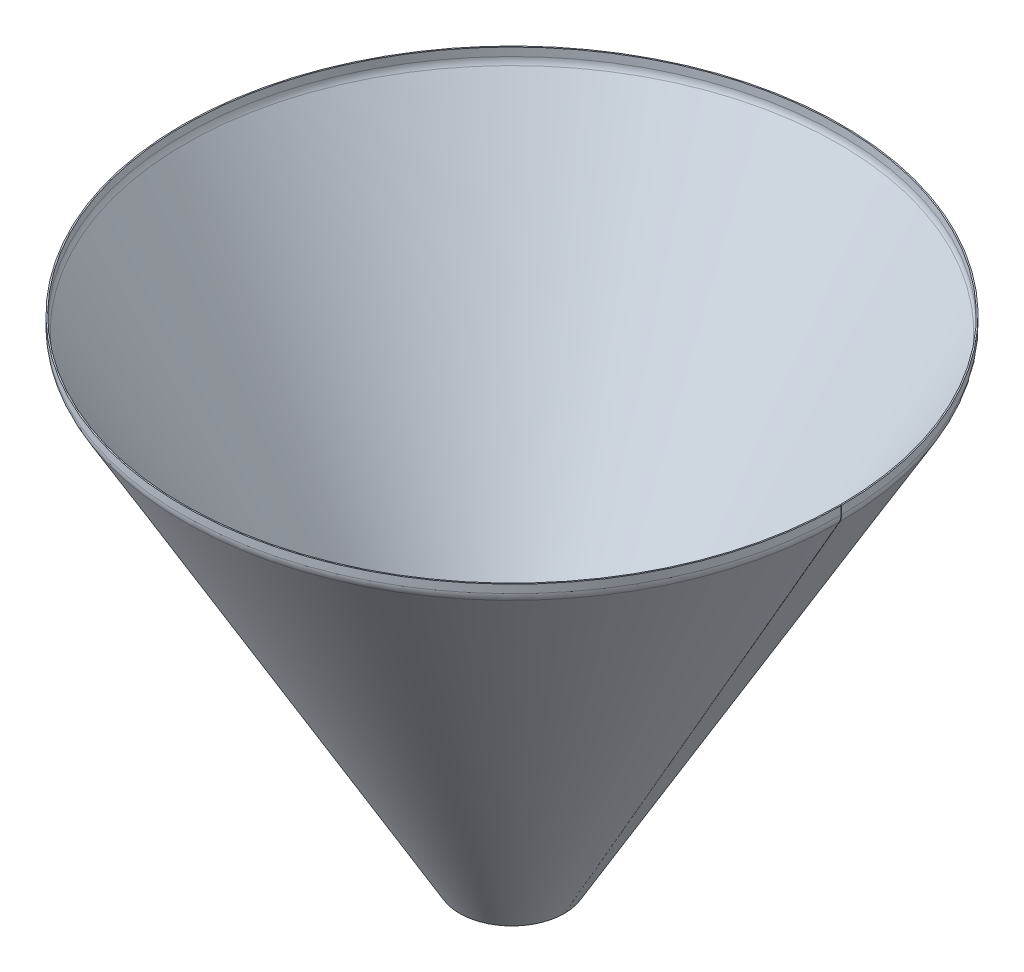
ISO-10303-21;
HEADER;
FILE_DESCRIPTION(('STEP AP214'),'2;1');
FILE_NAME('part.step','',(''),(''),'','','');
FILE_SCHEMA(('AUTOMOTIVE_DESIGN { 1 0 10303 214 1 1 1 1 }'));
ENDSEC;
DATA;
#1=APPLICATION_CONTEXT('core data for automotive mechanical design processes');
#2=APPLICATION_PROTOCOL_DEFINITION('international standard','automotive_design',2000,#1);
#3=PRODUCT_CONTEXT('',#1,'mechanical');
#4=PRODUCT('Part','Part','',(#3));
#5=PRODUCT_RELATED_PRODUCT_CATEGORY('part','',(#4));
#6=PRODUCT_DEFINITION_FORMATION('','',#4);
#7=PRODUCT_DEFINITION_CONTEXT('part definition',#1,'design');
#8=PRODUCT_DEFINITION('design','',#6,#7);
#9=PRODUCT_DEFINITION_SHAPE('','',#8);
#10=(LENGTH_UNIT() NAMED_UNIT(*) SI_UNIT(.MILLI.,.METRE.));
#11=(NAMED_UNIT(*) PLANE_ANGLE_UNIT() SI_UNIT($,.RADIAN.));
#12=(NAMED_UNIT(*) SI_UNIT($,.STERADIAN.) SOLID_ANGLE_UNIT());
#13=UNCERTAINTY_MEASURE_WITH_UNIT(LENGTH_MEASURE(1.E-05),#10,'distance_accuracy_value','');
#14=(GEOMETRIC_REPRESENTATION_CONTEXT(3) GLOBAL_UNCERTAINTY_ASSIGNED_CONTEXT((#13)) GLOBAL_UNIT_ASSIGNED_CONTEXT((#10,
#11,#12)) REPRESENTATION_CONTEXT('',''));
#15=CARTESIAN_POINT('',(0.,0.,0.));
#16=DIRECTION('',(0.,0.,1.));
#17=DIRECTION('',(1.,0.,0.));
#18=AXIS2_PLACEMENT_3D('',#15,#16,#17);
#19=CARTESIAN_POINT('',(-35.0011651613349,-20.,1.33517619991212));
#20=DIRECTION('',(0.0017453283658982,0.,-0.999998476913288));
#21=DIRECTION('',(-0.999998476913288,0.,-0.0017453283658982));
#22=AXIS2_PLACEMENT_3D('',#19,#20,#21);
#23=PLANE('',#22);
#24=DIRECTION('',(-0.999998476913288,0.,-0.00174532836589845));
#25=VECTOR('',#24,1.);
#26=CARTESIAN_POINT('',(-0.00121846936984582,-20.,1.39626269271876));
#27=LINE('',#26,#25);
#28=CARTESIAN_POINT('',(-0.00121846936984582,-20.,1.39626269271876));
#29=VERTEX_POINT('',#28);
#30=CARTESIAN_POINT('',(-3.00121390010977,-20.,1.39102670762109));
#31=VERTEX_POINT('',#30);
#32=EDGE_CURVE('E11',#29,#31,#27,.T.);
#33=ORIENTED_EDGE('',*,*,#32,.F.);
#34=CARTESIAN_POINT('',(-35.0011651613349,-20.,1.33517619991212));
#35=DIRECTION('',(-0.0017453283658982,0.,0.999998476913288));
#36=DIRECTION('',(0.999998476913288,0.,0.0017453283658982));
#37=AXIS2_PLACEMENT_3D('',#34,#35,#36);
#38=CIRCLE('',#37,35.);
#39=CARTESIAN_POINT('',(-4.69032219499199,-37.5,1.38807865451079));
#40=VERTEX_POINT('',#39);
#41=EDGE_CURVE('E140',#40,#29,#38,.T.);
#42=ORIENTED_EDGE('',*,*,#41,.F.);
#43=DIRECTION('',(-0.866024084752653,0.500000000000001,-0.00151149870281363));
#44=VECTOR('',#43,1.);
#45=CARTESIAN_POINT('',(-4.69032219499199,-37.5,1.38807865451079));
#46=LINE('',#45,#44);
#47=CARTESIAN_POINT('',(-7.28839444925,-36.,1.38354415840238));
#48=VERTEX_POINT('',#47);
#49=EDGE_CURVE('E53',#40,#48,#46,.T.);
#50=ORIENTED_EDGE('',*,*,#49,.T.);
#51=CARTESIAN_POINT('',(-35.001165161335,-20.,1.33517619991217));
#52=DIRECTION('',(-0.00174532836589826,0.,0.999998476913288));
#53=DIRECTION('',(0.999998476913288,0.,0.00174532836589826));
#54=AXIS2_PLACEMENT_3D('',#51,#52,#53);
#55=CIRCLE('',#54,32.);
#56=EDGE_CURVE('E137',#48,#31,#55,.T.);
#57=ORIENTED_EDGE('',*,*,#56,.T.);
#58=EDGE_LOOP('',(#33,#42,#50,#57));
#59=FACE_BOUND('',#58,.T.);
#60=ADVANCED_FACE('F43',(#59),#23,.T.);
#61=CARTESIAN_POINT('',(-4.69032219499207,-37.5,1.38807865451059));
#62=DIRECTION('',(0.0017453283658982,0.,-0.999998476913288));
#63=DIRECTION('',(0.499999238456645,0.866025403784438,0.000872664182949101));
#64=AXIS2_PLACEMENT_3D('',#61,#62,#63);
#65=PLANE('',#64);
#66=ORIENTED_EDGE('',*,*,#49,.F.);
#67=DIRECTION('',(0.499999238456645,0.866025403784438,0.000872664182949101));
#68=VECTOR('',#67,1.);
#69=CARTESIAN_POINT('',(-4.69032219499207,-37.5,1.38807865451059));
#70=LINE('',#69,#68);
#71=CARTESIAN_POINT('',(-672.500194193556,-1194.18238982516,0.222529366652052));
#72=VERTEX_POINT('',#71);
#73=EDGE_CURVE('E180',#72,#40,#70,.T.);
#74=ORIENTED_EDGE('',*,*,#73,.F.);
#75=DIRECTION('',(-0.866024084752653,0.500000000000001,-0.00151149870281363));
#76=VECTOR('',#75,1.);
#77=CARTESIAN_POINT('',(-672.500194193556,-1194.18238982516,0.222529366652052));
#78=LINE('',#77,#76);
#79=CARTESIAN_POINT('',(-675.098266447814,-1192.68238982516,0.217994870543588));
#80=VERTEX_POINT('',#79);
#81=EDGE_CURVE('E129',#72,#80,#78,.T.);
#82=ORIENTED_EDGE('',*,*,#81,.T.);
#83=DIRECTION('',(0.499999238456645,0.866025403784438,0.000872664182949132));
#84=VECTOR('',#83,1.);
#85=CARTESIAN_POINT('',(-675.098266447814,-1192.68238982516,0.217994870543588));
#86=LINE('',#85,#84);
#87=EDGE_CURVE('E157',#80,#48,#86,.T.);
#88=ORIENTED_EDGE('',*,*,#87,.T.);
#89=EDGE_LOOP('',(#66,#74,#82,#88));
#90=FACE_BOUND('',#89,.T.);
#91=ADVANCED_FACE('F158',(#90),#65,.T.);
#92=CARTESIAN_POINT('',(-800.,-1194.18238982516,0.));
#93=DIRECTION('',(0.,-1.,0.));
#94=DIRECTION('',(0.,0.,-1.));
#95=AXIS2_PLACEMENT_3D('',#92,#93,#94);
#96=CONICAL_SURFACE('',#95,127.5,1.0471975511966);
#97=ORIENTED_EDGE('',*,*,#81,.F.);
#98=CARTESIAN_POINT('',(-800.,-1194.18238982516,0.));
#99=DIRECTION('',(0.,1.,0.));
#100=DIRECTION('',(1.,0.,0.));
#101=AXIS2_PLACEMENT_3D('',#98,#99,#100);
#102=CIRCLE('',#101,127.5);
#103=CARTESIAN_POINT('',(-672.5,-1194.18238982516,0.));
#104=VERTEX_POINT('',#103);
#105=EDGE_CURVE('E107',#104,#72,#102,.T.);
#106=ORIENTED_EDGE('',*,*,#105,.F.);
#107=DIRECTION('',(-0.866025403784438,0.500000000000001,0.));
#108=VECTOR('',#107,1.);
#109=CARTESIAN_POINT('',(-672.5,-1194.18238982516,0.));
#110=LINE('',#109,#108);
#111=CARTESIAN_POINT('',(-675.098076211353,-1192.68238982516,0.));
#112=VERTEX_POINT('',#111);
#113=EDGE_CURVE('E126',#104,#112,#110,.T.);
#114=ORIENTED_EDGE('',*,*,#113,.T.);
#115=CARTESIAN_POINT('',(-800.,-1192.68238982516,0.));
#116=DIRECTION('',(0.,1.,0.));
#117=DIRECTION('',(0.,0.,1.));
#118=AXIS2_PLACEMENT_3D('',#115,#116,#117);
#119=CIRCLE('',#118,124.901923788647);
#120=EDGE_CURVE('E162',#112,#80,#119,.T.);
#121=ORIENTED_EDGE('',*,*,#120,.T.);
#122=EDGE_LOOP('',(#97,#106,#114,#121));
#123=FACE_BOUND('',#122,.T.);
#124=ADVANCED_FACE('F219',(#123),#96,.F.);
#125=CARTESIAN_POINT('',(-4.68911086754468,-37.5,0.));
#126=DIRECTION('',(0.,0.,-1.));
#127=DIRECTION('',(0.500000000000001,0.866025403784438,0.));
#128=AXIS2_PLACEMENT_3D('',#125,#126,#127);
#129=PLANE('',#128);
#130=ORIENTED_EDGE('',*,*,#113,.F.);
#131=DIRECTION('',(0.500000000000001,0.866025403784438,0.));
#132=VECTOR('',#131,1.);
#133=CARTESIAN_POINT('',(-4.68911086754468,-37.5,0.));
#134=LINE('',#133,#132);
#135=CARTESIAN_POINT('',(-4.68911086754464,-37.5,0.));
#136=VERTEX_POINT('',#135);
#137=EDGE_CURVE('E177',#104,#136,#134,.T.);
#138=ORIENTED_EDGE('',*,*,#137,.T.);
#139=DIRECTION('',(-0.866025403784438,0.5,0.));
#140=VECTOR('',#139,1.);
#141=CARTESIAN_POINT('',(-4.68911086754464,-37.5,0.));
#142=LINE('',#141,#140);
#143=CARTESIAN_POINT('',(-7.28718707889797,-36.,0.));
#144=VERTEX_POINT('',#143);
#145=EDGE_CURVE('E123',#136,#144,#142,.T.);
#146=ORIENTED_EDGE('',*,*,#145,.T.);
#147=DIRECTION('',(0.500000000000001,0.866025403784438,0.));
#148=VECTOR('',#147,1.);
#149=CARTESIAN_POINT('',(-675.098076211353,-1192.68238982516,0.));
#150=LINE('',#149,#148);
#151=EDGE_CURVE('E114',#112,#144,#150,.T.);
#152=ORIENTED_EDGE('',*,*,#151,.F.);
#153=EDGE_LOOP('',(#130,#138,#146,#152));
#154=FACE_BOUND('',#153,.T.);
#155=ADVANCED_FACE('F224',(#154),#129,.F.);
#156=CARTESIAN_POINT('',(-35.,-20.,0.));
#157=DIRECTION('',(0.,0.,-1.));
#158=DIRECTION('',(-1.,0.,0.));
#159=AXIS2_PLACEMENT_3D('',#156,#157,#158);
#160=PLANE('',#159);
#161=ORIENTED_EDGE('',*,*,#145,.F.);
#162=CARTESIAN_POINT('',(-35.,-20.,0.));
#163=DIRECTION('',(0.,0.,1.));
#164=DIRECTION('',(1.,0.,0.));
#165=AXIS2_PLACEMENT_3D('',#162,#163,#164);
#166=CIRCLE('',#165,35.);
#167=CARTESIAN_POINT('',(0.,-20.,0.));
#168=VERTEX_POINT('',#167);
#169=EDGE_CURVE('E108',#136,#168,#166,.T.);
#170=ORIENTED_EDGE('',*,*,#169,.T.);
#171=DIRECTION('',(-1.,0.,0.));
#172=VECTOR('',#171,1.);
#173=CARTESIAN_POINT('',(0.,-20.,0.));
#174=LINE('',#173,#172);
#175=CARTESIAN_POINT('',(-3.,-20.,0.));
#176=VERTEX_POINT('',#175);
#177=EDGE_CURVE('E97',#168,#176,#174,.T.);
#178=ORIENTED_EDGE('',*,*,#177,.T.);
#179=CARTESIAN_POINT('',(-35.,-20.,0.));
#180=DIRECTION('',(0.,0.,1.));
#181=DIRECTION('',(1.,0.,0.));
#182=AXIS2_PLACEMENT_3D('',#179,#180,#181);
#183=CIRCLE('',#182,32.);
#184=EDGE_CURVE('E117',#144,#176,#183,.T.);
#185=ORIENTED_EDGE('',*,*,#184,.F.);
#186=EDGE_LOOP('',(#161,#170,#178,#185));
#187=FACE_BOUND('',#186,.T.);
#188=ADVANCED_FACE('F205',(#187),#160,.F.);
#189=CARTESIAN_POINT('',(0.,-10.,0.));
#190=DIRECTION('',(0.,0.,-1.));
#191=DIRECTION('',(0.,1.,0.));
#192=AXIS2_PLACEMENT_3D('',#189,#190,#191);
#193=PLANE('',#192);
#194=ORIENTED_EDGE('',*,*,#177,.F.);
#195=DIRECTION('',(0.,1.,0.));
#196=VECTOR('',#195,1.);
#197=CARTESIAN_POINT('',(0.,0.,0.));
#198=LINE('',#197,#196);
#199=CARTESIAN_POINT('',(0.,0.,0.));
#200=VERTEX_POINT('',#199);
#201=EDGE_CURVE('E100',#168,#200,#198,.T.);
#202=ORIENTED_EDGE('',*,*,#201,.T.);
#203=DIRECTION('',(-1.,0.,0.));
#204=VECTOR('',#203,1.);
#205=CARTESIAN_POINT('',(0.,0.,0.));
#206=LINE('',#205,#204);
#207=CARTESIAN_POINT('',(-3.,0.,0.));
#208=VERTEX_POINT('',#207);
#209=EDGE_CURVE('E86',#200,#208,#206,.T.);
#210=ORIENTED_EDGE('',*,*,#209,.T.);
#211=DIRECTION('',(0.,1.,0.));
#212=VECTOR('',#211,1.);
#213=CARTESIAN_POINT('',(-3.,-1194.18238982516,0.));
#214=LINE('',#213,#212);
#215=EDGE_CURVE('E172',#176,#208,#214,.T.);
#216=ORIENTED_EDGE('',*,*,#215,.F.);
#217=EDGE_LOOP('',(#194,#202,#210,#216));
#218=FACE_BOUND('',#217,.T.);
#219=ADVANCED_FACE('F101',(#218),#193,.F.);
#220=CARTESIAN_POINT('',(-800.,0.,0.));
#221=DIRECTION('',(0.,-1.,0.));
#222=DIRECTION('',(0.,0.,-1.));
#223=AXIS2_PLACEMENT_3D('',#220,#221,#222);
#224=PLANE('',#223);
#225=ORIENTED_EDGE('',*,*,#209,.F.);
#226=CARTESIAN_POINT('',(-800.,0.,0.));
#227=DIRECTION('',(0.,1.,0.));
#228=DIRECTION('',(1.,0.,0.));
#229=AXIS2_PLACEMENT_3D('',#226,#227,#228);
#230=CIRCLE('',#229,800.);
#231=CARTESIAN_POINT('',(-0.00121846936984582,0.,1.39626269271876));
#232=VERTEX_POINT('',#231);
#233=EDGE_CURVE('E90',#200,#232,#230,.T.);
#234=ORIENTED_EDGE('',*,*,#233,.T.);
#235=DIRECTION('',(-0.999998476913288,0.,-0.00174532836589845));
#236=VECTOR('',#235,1.);
#237=CARTESIAN_POINT('',(-0.00121846936984582,0.,1.39626269271876));
#238=LINE('',#237,#236);
#239=CARTESIAN_POINT('',(-3.00121390010977,0.,1.39102670762091));
#240=VERTEX_POINT('',#239);
#241=EDGE_CURVE('E47',#232,#240,#238,.T.);
#242=ORIENTED_EDGE('',*,*,#241,.T.);
#243=CARTESIAN_POINT('',(-800.,0.,0.));
#244=DIRECTION('',(0.,1.,0.));
#245=DIRECTION('',(0.,0.,1.));
#246=AXIS2_PLACEMENT_3D('',#243,#244,#245);
#247=CIRCLE('',#246,797.);
#248=EDGE_CURVE('E93',#208,#240,#247,.T.);
#249=ORIENTED_EDGE('',*,*,#248,.F.);
#250=EDGE_LOOP('',(#225,#234,#242,#249));
#251=FACE_BOUND('',#250,.T.);
#252=ADVANCED_FACE('F88',(#251),#224,.F.);
#253=CARTESIAN_POINT('',(-0.0012184693698446,-10.,1.39626269271856));
#254=DIRECTION('',(0.0017453283658982,0.,-0.999998476913288));
#255=DIRECTION('',(0.,1.,0.));
#256=AXIS2_PLACEMENT_3D('',#253,#254,#255);
#257=PLANE('',#256);
#258=DIRECTION('',(0.,1.,0.));
#259=VECTOR('',#258,1.);
#260=CARTESIAN_POINT('',(-0.00121846936984582,0.,1.39626269271856));
#261=LINE('',#260,#259);
#262=EDGE_CURVE('E113',#29,#232,#261,.T.);
#263=ORIENTED_EDGE('',*,*,#262,.F.);
#264=ORIENTED_EDGE('',*,*,#32,.T.);
#265=DIRECTION('',(0.,1.,0.));
#266=VECTOR('',#265,1.);
#267=CARTESIAN_POINT('',(-3.00121390010977,-1194.18238982516,1.39102670762091));
#268=LINE('',#267,#266);
#269=EDGE_CURVE('E171',#31,#240,#268,.T.);
#270=ORIENTED_EDGE('',*,*,#269,.T.);
#271=ORIENTED_EDGE('',*,*,#241,.F.);
#272=EDGE_LOOP('',(#263,#264,#270,#271));
#273=FACE_BOUND('',#272,.T.);
#274=ADVANCED_FACE('F45',(#273),#257,.T.);
#275=CARTESIAN_POINT('',(-800.,-1194.18238982516,0.));
#276=DIRECTION('',(0.,1.,0.));
#277=DIRECTION('',(0.,0.,1.));
#278=AXIS2_PLACEMENT_3D('',#275,#276,#277);
#279=CYLINDRICAL_SURFACE('',#278,797.);
#280=ORIENTED_EDGE('',*,*,#248,.T.);
#281=ORIENTED_EDGE('',*,*,#269,.F.);
#282=CARTESIAN_POINT('',(-800.,-20.,0.));
#283=DIRECTION('',(0.,1.,0.));
#284=DIRECTION('',(0.,0.,1.));
#285=AXIS2_PLACEMENT_3D('',#282,#283,#284);
#286=CIRCLE('',#285,797.);
#287=EDGE_CURVE('E154',#176,#31,#286,.T.);
#288=ORIENTED_EDGE('',*,*,#287,.F.);
#289=ORIENTED_EDGE('',*,*,#215,.T.);
#290=EDGE_LOOP('',(#280,#281,#288,#289));
#291=FACE_BOUND('',#290,.T.);
#292=ADVANCED_FACE('F207',(#291),#279,.F.);
#293=CARTESIAN_POINT('',(-800.,-20.,0.));
#294=DIRECTION('',(0.,1.,0.));
#295=DIRECTION('',(0.,0.,1.));
#296=AXIS2_PLACEMENT_3D('',#293,#294,#295);
#297=TOROIDAL_SURFACE('',#296,765.,32.);
#298=ORIENTED_EDGE('',*,*,#287,.T.);
#299=ORIENTED_EDGE('',*,*,#56,.F.);
#300=CARTESIAN_POINT('',(-800.,-36.,0.));
#301=DIRECTION('',(0.,1.,0.));
#302=DIRECTION('',(0.,0.,1.));
#303=AXIS2_PLACEMENT_3D('',#300,#301,#302);
#304=CIRCLE('',#303,792.712812921102);
#305=EDGE_CURVE('E152',#144,#48,#304,.T.);
#306=ORIENTED_EDGE('',*,*,#305,.F.);
#307=ORIENTED_EDGE('',*,*,#184,.T.);
#308=EDGE_LOOP('',(#298,#299,#306,#307));
#309=FACE_BOUND('',#308,.T.);
#310=ADVANCED_FACE('F148',(#309),#297,.F.);
#311=CARTESIAN_POINT('',(-800.,-1192.68238982516,0.));
#312=DIRECTION('',(0.,1.,0.));
#313=DIRECTION('',(0.,0.,1.));
#314=AXIS2_PLACEMENT_3D('',#311,#312,#313);
#315=CONICAL_SURFACE('',#314,124.901923788647,0.5235987755983);
#316=ORIENTED_EDGE('',*,*,#305,.T.);
#317=ORIENTED_EDGE('',*,*,#87,.F.);
#318=ORIENTED_EDGE('',*,*,#120,.F.);
#319=ORIENTED_EDGE('',*,*,#151,.T.);
#320=EDGE_LOOP('',(#316,#317,#318,#319));
#321=FACE_BOUND('',#320,.T.);
#322=ADVANCED_FACE('F164',(#321),#315,.F.);
#323=CARTESIAN_POINT('',(-800.,-1194.18238982516,0.));
#324=DIRECTION('',(0.,1.,0.));
#325=DIRECTION('',(0.,0.,1.));
#326=AXIS2_PLACEMENT_3D('',#323,#324,#325);
#327=CYLINDRICAL_SURFACE('',#326,800.);
#328=ORIENTED_EDGE('',*,*,#233,.F.);
#329=ORIENTED_EDGE('',*,*,#201,.F.);
#330=CARTESIAN_POINT('',(-800.,-20.,0.));
#331=DIRECTION('',(0.,1.,0.));
#332=DIRECTION('',(1.,0.,0.));
#333=AXIS2_PLACEMENT_3D('',#330,#331,#332);
#334=CIRCLE('',#333,800.);
#335=EDGE_CURVE('E119',#168,#29,#334,.T.);
#336=ORIENTED_EDGE('',*,*,#335,.T.);
#337=ORIENTED_EDGE('',*,*,#262,.T.);
#338=EDGE_LOOP('',(#328,#329,#336,#337));
#339=FACE_BOUND('',#338,.T.);
#340=ADVANCED_FACE('F111',(#339),#327,.T.);
#341=CARTESIAN_POINT('',(-800.,-20.,0.));
#342=DIRECTION('',(0.,1.,0.));
#343=DIRECTION('',(0.,0.,1.));
#344=AXIS2_PLACEMENT_3D('',#341,#342,#343);
#345=TOROIDAL_SURFACE('',#344,765.,35.);
#346=ORIENTED_EDGE('',*,*,#335,.F.);
#347=ORIENTED_EDGE('',*,*,#169,.F.);
#348=CARTESIAN_POINT('',(-800.,-37.5000000000001,0.));
#349=DIRECTION('',(0.,1.,0.));
#350=DIRECTION('',(1.,0.,0.));
#351=AXIS2_PLACEMENT_3D('',#348,#349,#350);
#352=CIRCLE('',#351,795.310889132455);
#353=EDGE_CURVE('E183',#136,#40,#352,.T.);
#354=ORIENTED_EDGE('',*,*,#353,.T.);
#355=ORIENTED_EDGE('',*,*,#41,.T.);
#356=EDGE_LOOP('',(#346,#347,#354,#355));
#357=FACE_BOUND('',#356,.T.);
#358=ADVANCED_FACE('F191',(#357),#345,.T.);
#359=CARTESIAN_POINT('',(-800.,-1194.18238982516,0.));
#360=DIRECTION('',(0.,1.,0.));
#361=DIRECTION('',(0.,0.,1.));
#362=AXIS2_PLACEMENT_3D('',#359,#360,#361);
#363=CONICAL_SURFACE('',#362,127.5,0.5235987755983);
#364=ORIENTED_EDGE('',*,*,#353,.F.);
#365=ORIENTED_EDGE('',*,*,#137,.F.);
#366=ORIENTED_EDGE('',*,*,#105,.T.);
#367=ORIENTED_EDGE('',*,*,#73,.T.);
#368=EDGE_LOOP('',(#364,#365,#366,#367));
#369=FACE_BOUND('',#368,.T.);
#370=ADVANCED_FACE('F238',(#369),#363,.T.);
#371=CLOSED_SHELL('',(#60,#91,#124,#155,#188,#219,#252,#274,#292,#310,#322,#340,#358,#370));
#372=MANIFOLD_SOLID_BREP('B2',#371);
#373=ADVANCED_BREP_SHAPE_REPRESENTATION('',(#18,#372),#14);
#374=SHAPE_DEFINITION_REPRESENTATION(#9,#373);
ENDSEC;
END-ISO-10303-21;
